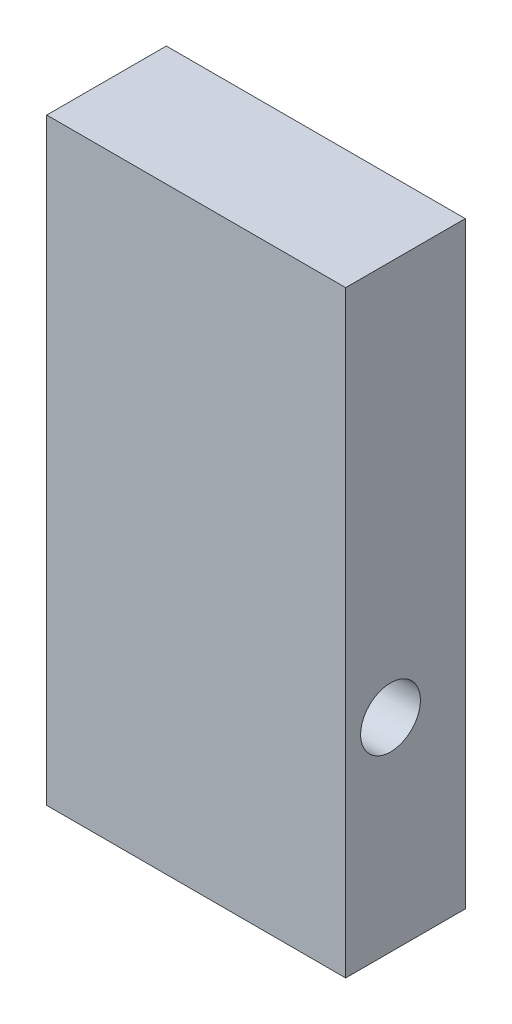
ISO-10303-21;
HEADER;
FILE_DESCRIPTION(('STEP AP214'),'2;1');
FILE_NAME('part.step','',(''),(''),'','','');
FILE_SCHEMA(('AUTOMOTIVE_DESIGN { 1 0 10303 214 1 1 1 1 }'));
ENDSEC;
DATA;
#1=APPLICATION_CONTEXT('core data for automotive mechanical design processes');
#2=APPLICATION_PROTOCOL_DEFINITION('international standard','automotive_design',2000,#1);
#3=PRODUCT_CONTEXT('',#1,'mechanical');
#4=PRODUCT('Part','Part','',(#3));
#5=PRODUCT_RELATED_PRODUCT_CATEGORY('part','',(#4));
#6=PRODUCT_DEFINITION_FORMATION('','',#4);
#7=PRODUCT_DEFINITION_CONTEXT('part definition',#1,'design');
#8=PRODUCT_DEFINITION('design','',#6,#7);
#9=PRODUCT_DEFINITION_SHAPE('','',#8);
#10=(LENGTH_UNIT() NAMED_UNIT(*) SI_UNIT(.MILLI.,.METRE.));
#11=(NAMED_UNIT(*) PLANE_ANGLE_UNIT() SI_UNIT($,.RADIAN.));
#12=(NAMED_UNIT(*) SI_UNIT($,.STERADIAN.) SOLID_ANGLE_UNIT());
#13=UNCERTAINTY_MEASURE_WITH_UNIT(LENGTH_MEASURE(1.E-05),#10,'distance_accuracy_value','');
#14=(GEOMETRIC_REPRESENTATION_CONTEXT(3) GLOBAL_UNCERTAINTY_ASSIGNED_CONTEXT((#13)) GLOBAL_UNIT_ASSIGNED_CONTEXT((#10,
#11,#12)) REPRESENTATION_CONTEXT('',''));
#15=CARTESIAN_POINT('',(0.,0.,0.));
#16=DIRECTION('',(0.,0.,1.));
#17=DIRECTION('',(1.,0.,0.));
#18=AXIS2_PLACEMENT_3D('',#15,#16,#17);
#19=CARTESIAN_POINT('',(-25.,50.,20.));
#20=DIRECTION('',(1.,0.,0.));
#21=DIRECTION('',(0.,1.,0.));
#22=AXIS2_PLACEMENT_3D('',#19,#20,#21);
#23=PLANE('',#22);
#24=CARTESIAN_POINT('',(-25.,-16.,12.5));
#25=DIRECTION('',(-1.,0.,0.));
#26=DIRECTION('',(0.,-1.,0.));
#27=AXIS2_PLACEMENT_3D('',#24,#25,#26);
#28=CIRCLE('',#27,5.);
#29=CARTESIAN_POINT('',(-25.,-21.,12.5));
#30=VERTEX_POINT('',#29);
#31=EDGE_CURVE('E113',#30,#30,#28,.T.);
#32=ORIENTED_EDGE('',*,*,#31,.F.);
#33=EDGE_LOOP('',(#32));
#34=FACE_BOUND('',#33,.T.);
#35=DIRECTION('',(0.,-1.,0.));
#36=VECTOR('',#35,1.);
#37=CARTESIAN_POINT('',(-25.,50.,0.));
#38=LINE('',#37,#36);
#39=CARTESIAN_POINT('',(-25.,50.,0.));
#40=VERTEX_POINT('',#39);
#41=CARTESIAN_POINT('',(-25.,-50.,0.));
#42=VERTEX_POINT('',#41);
#43=EDGE_CURVE('E100',#40,#42,#38,.T.);
#44=ORIENTED_EDGE('',*,*,#43,.T.);
#45=DIRECTION('',(0.,0.,-1.));
#46=VECTOR('',#45,1.);
#47=CARTESIAN_POINT('',(-25.,-50.,20.));
#48=LINE('',#47,#46);
#49=CARTESIAN_POINT('',(-25.,-50.,20.));
#50=VERTEX_POINT('',#49);
#51=EDGE_CURVE('E11',#50,#42,#48,.T.);
#52=ORIENTED_EDGE('',*,*,#51,.F.);
#53=DIRECTION('',(0.,-1.,0.));
#54=VECTOR('',#53,1.);
#55=CARTESIAN_POINT('',(-25.,50.,20.));
#56=LINE('',#55,#54);
#57=CARTESIAN_POINT('',(-25.,50.,20.));
#58=VERTEX_POINT('',#57);
#59=EDGE_CURVE('E87',#58,#50,#56,.T.);
#60=ORIENTED_EDGE('',*,*,#59,.F.);
#61=DIRECTION('',(0.,0.,-1.));
#62=VECTOR('',#61,1.);
#63=CARTESIAN_POINT('',(-25.,50.,20.));
#64=LINE('',#63,#62);
#65=EDGE_CURVE('E96',#58,#40,#64,.T.);
#66=ORIENTED_EDGE('',*,*,#65,.T.);
#67=EDGE_LOOP('',(#44,#52,#60,#66));
#68=FACE_BOUND('',#67,.T.);
#69=ADVANCED_FACE('F35',(#34,#68),#23,.F.);
#70=CARTESIAN_POINT('',(25.,-50.,20.));
#71=DIRECTION('',(0.,1.,0.));
#72=DIRECTION('',(0.,0.,1.));
#73=AXIS2_PLACEMENT_3D('',#70,#71,#72);
#74=PLANE('',#73);
#75=DIRECTION('',(1.,0.,0.));
#76=VECTOR('',#75,1.);
#77=CARTESIAN_POINT('',(25.,-50.,0.));
#78=LINE('',#77,#76);
#79=CARTESIAN_POINT('',(25.,-50.,0.));
#80=VERTEX_POINT('',#79);
#81=EDGE_CURVE('E91',#42,#80,#78,.T.);
#82=ORIENTED_EDGE('',*,*,#81,.T.);
#83=DIRECTION('',(0.,0.,-1.));
#84=VECTOR('',#83,1.);
#85=CARTESIAN_POINT('',(25.,-50.,20.));
#86=LINE('',#85,#84);
#87=CARTESIAN_POINT('',(25.,-50.,20.));
#88=VERTEX_POINT('',#87);
#89=EDGE_CURVE('E44',#88,#80,#86,.T.);
#90=ORIENTED_EDGE('',*,*,#89,.F.);
#91=DIRECTION('',(1.,0.,0.));
#92=VECTOR('',#91,1.);
#93=CARTESIAN_POINT('',(25.,-50.,20.));
#94=LINE('',#93,#92);
#95=EDGE_CURVE('E82',#50,#88,#94,.T.);
#96=ORIENTED_EDGE('',*,*,#95,.F.);
#97=ORIENTED_EDGE('',*,*,#51,.T.);
#98=EDGE_LOOP('',(#82,#90,#96,#97));
#99=FACE_BOUND('',#98,.T.);
#100=ADVANCED_FACE('F90',(#99),#74,.F.);
#101=CARTESIAN_POINT('',(25.,50.,20.));
#102=DIRECTION('',(-1.,0.,0.));
#103=DIRECTION('',(0.,-1.,0.));
#104=AXIS2_PLACEMENT_3D('',#101,#102,#103);
#105=PLANE('',#104);
#106=CARTESIAN_POINT('',(25.,-16.,12.5));
#107=DIRECTION('',(-1.,0.,0.));
#108=DIRECTION('',(0.,-1.,0.));
#109=AXIS2_PLACEMENT_3D('',#106,#107,#108);
#110=CIRCLE('',#109,5.);
#111=CARTESIAN_POINT('',(25.,-21.,12.5));
#112=VERTEX_POINT('',#111);
#113=EDGE_CURVE('E38',#112,#112,#110,.T.);
#114=ORIENTED_EDGE('',*,*,#113,.T.);
#115=EDGE_LOOP('',(#114));
#116=FACE_BOUND('',#115,.T.);
#117=DIRECTION('',(0.,1.,0.));
#118=VECTOR('',#117,1.);
#119=CARTESIAN_POINT('',(25.,50.,0.));
#120=LINE('',#119,#118);
#121=CARTESIAN_POINT('',(25.,50.,0.));
#122=VERTEX_POINT('',#121);
#123=EDGE_CURVE('E69',#80,#122,#120,.T.);
#124=ORIENTED_EDGE('',*,*,#123,.T.);
#125=DIRECTION('',(0.,0.,-1.));
#126=VECTOR('',#125,1.);
#127=CARTESIAN_POINT('',(25.,50.,20.));
#128=LINE('',#127,#126);
#129=CARTESIAN_POINT('',(25.,50.,20.));
#130=VERTEX_POINT('',#129);
#131=EDGE_CURVE('E92',#130,#122,#128,.T.);
#132=ORIENTED_EDGE('',*,*,#131,.F.);
#133=DIRECTION('',(0.,1.,0.));
#134=VECTOR('',#133,1.);
#135=CARTESIAN_POINT('',(25.,50.,20.));
#136=LINE('',#135,#134);
#137=EDGE_CURVE('E85',#88,#130,#136,.T.);
#138=ORIENTED_EDGE('',*,*,#137,.F.);
#139=ORIENTED_EDGE('',*,*,#89,.T.);
#140=EDGE_LOOP('',(#124,#132,#138,#139));
#141=FACE_BOUND('',#140,.T.);
#142=ADVANCED_FACE('F94',(#116,#141),#105,.F.);
#143=CARTESIAN_POINT('',(25.,50.,20.));
#144=DIRECTION('',(0.,-1.,0.));
#145=DIRECTION('',(0.,0.,-1.));
#146=AXIS2_PLACEMENT_3D('',#143,#144,#145);
#147=PLANE('',#146);
#148=DIRECTION('',(-1.,0.,0.));
#149=VECTOR('',#148,1.);
#150=CARTESIAN_POINT('',(25.,50.,0.));
#151=LINE('',#150,#149);
#152=EDGE_CURVE('E75',#122,#40,#151,.T.);
#153=ORIENTED_EDGE('',*,*,#152,.T.);
#154=ORIENTED_EDGE('',*,*,#65,.F.);
#155=DIRECTION('',(-1.,0.,0.));
#156=VECTOR('',#155,1.);
#157=CARTESIAN_POINT('',(25.,50.,20.));
#158=LINE('',#157,#156);
#159=EDGE_CURVE('E52',#130,#58,#158,.T.);
#160=ORIENTED_EDGE('',*,*,#159,.F.);
#161=ORIENTED_EDGE('',*,*,#131,.T.);
#162=EDGE_LOOP('',(#153,#154,#160,#161));
#163=FACE_BOUND('',#162,.T.);
#164=ADVANCED_FACE('F107',(#163),#147,.F.);
#165=CARTESIAN_POINT('',(0.,0.,20.));
#166=DIRECTION('',(0.,0.,-1.));
#167=DIRECTION('',(-1.,0.,0.));
#168=AXIS2_PLACEMENT_3D('',#165,#166,#167);
#169=PLANE('',#168);
#170=ORIENTED_EDGE('',*,*,#59,.T.);
#171=ORIENTED_EDGE('',*,*,#95,.T.);
#172=ORIENTED_EDGE('',*,*,#137,.T.);
#173=ORIENTED_EDGE('',*,*,#159,.T.);
#174=EDGE_LOOP('',(#170,#171,#172,#173));
#175=FACE_BOUND('',#174,.T.);
#176=ADVANCED_FACE('F83',(#175),#169,.F.);
#177=CARTESIAN_POINT('',(0.,0.,0.));
#178=DIRECTION('',(0.,0.,-1.));
#179=DIRECTION('',(-1.,0.,0.));
#180=AXIS2_PLACEMENT_3D('',#177,#178,#179);
#181=PLANE('',#180);
#182=ORIENTED_EDGE('',*,*,#43,.F.);
#183=ORIENTED_EDGE('',*,*,#152,.F.);
#184=ORIENTED_EDGE('',*,*,#123,.F.);
#185=ORIENTED_EDGE('',*,*,#81,.F.);
#186=EDGE_LOOP('',(#182,#183,#184,#185));
#187=FACE_BOUND('',#186,.T.);
#188=ADVANCED_FACE('F110',(#187),#181,.T.);
#189=CARTESIAN_POINT('',(105.,-16.,12.5));
#190=DIRECTION('',(-1.,0.,0.));
#191=DIRECTION('',(0.,-1.,0.));
#192=AXIS2_PLACEMENT_3D('',#189,#190,#191);
#193=CYLINDRICAL_SURFACE('',#192,5.);
#194=ORIENTED_EDGE('',*,*,#31,.T.);
#195=EDGE_LOOP('',(#194));
#196=FACE_BOUND('',#195,.T.);
#197=ORIENTED_EDGE('',*,*,#113,.F.);
#198=EDGE_LOOP('',(#197));
#199=FACE_BOUND('',#198,.T.);
#200=ADVANCED_FACE('F121',(#196,#199),#193,.F.);
#201=CLOSED_SHELL('',(#69,#100,#142,#164,#176,#188,#200));
#202=MANIFOLD_SOLID_BREP('B2',#201);
#203=ADVANCED_BREP_SHAPE_REPRESENTATION('',(#18,#202),#14);
#204=SHAPE_DEFINITION_REPRESENTATION(#9,#203);
ENDSEC;
END-ISO-10303-21;
